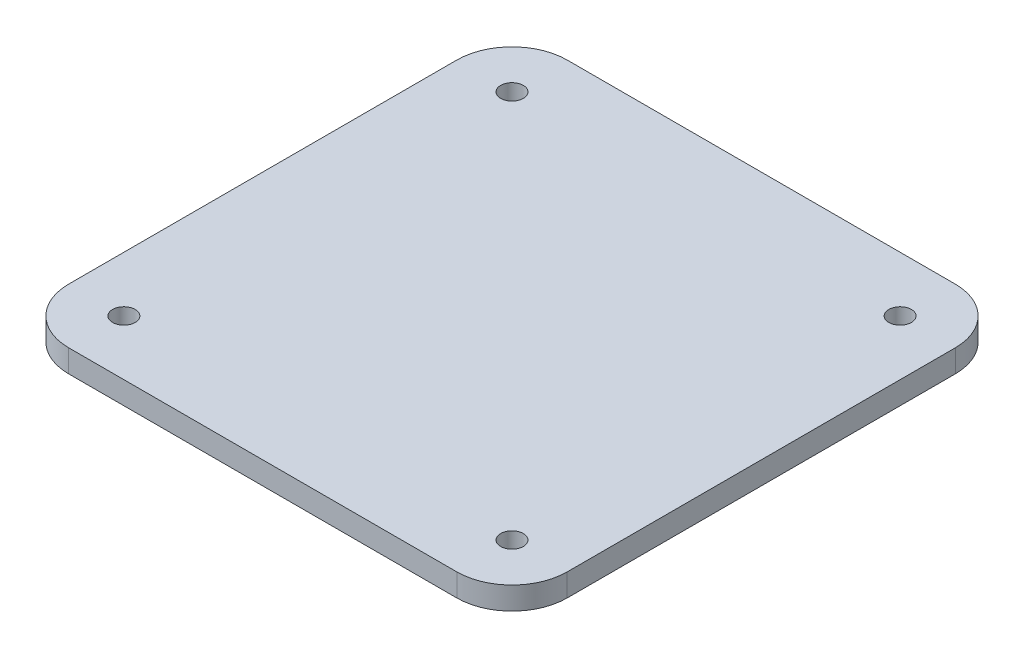
ISO-10303-21;
HEADER;
FILE_DESCRIPTION(('STEP AP214'),'2;1');
FILE_NAME('part.step','',(''),(''),'','','');
FILE_SCHEMA(('AUTOMOTIVE_DESIGN { 1 0 10303 214 1 1 1 1 }'));
ENDSEC;
DATA;
#1=APPLICATION_CONTEXT('core data for automotive mechanical design processes');
#2=APPLICATION_PROTOCOL_DEFINITION('international standard','automotive_design',2000,#1);
#3=PRODUCT_CONTEXT('',#1,'mechanical');
#4=PRODUCT('Part','Part','',(#3));
#5=PRODUCT_RELATED_PRODUCT_CATEGORY('part','',(#4));
#6=PRODUCT_DEFINITION_FORMATION('','',#4);
#7=PRODUCT_DEFINITION_CONTEXT('part definition',#1,'design');
#8=PRODUCT_DEFINITION('design','',#6,#7);
#9=PRODUCT_DEFINITION_SHAPE('','',#8);
#10=(LENGTH_UNIT() NAMED_UNIT(*) SI_UNIT(.MILLI.,.METRE.));
#11=(NAMED_UNIT(*) PLANE_ANGLE_UNIT() SI_UNIT($,.RADIAN.));
#12=(NAMED_UNIT(*) SI_UNIT($,.STERADIAN.) SOLID_ANGLE_UNIT());
#13=UNCERTAINTY_MEASURE_WITH_UNIT(LENGTH_MEASURE(1.E-05),#10,'distance_accuracy_value','');
#14=(GEOMETRIC_REPRESENTATION_CONTEXT(3) GLOBAL_UNCERTAINTY_ASSIGNED_CONTEXT((#13)) GLOBAL_UNIT_ASSIGNED_CONTEXT((#10,
#11,#12)) REPRESENTATION_CONTEXT('',''));
#15=CARTESIAN_POINT('',(0.,0.,0.));
#16=DIRECTION('',(0.,0.,1.));
#17=DIRECTION('',(1.,0.,0.));
#18=AXIS2_PLACEMENT_3D('',#15,#16,#17);
#19=CARTESIAN_POINT('',(-109.,12.7,109.));
#20=DIRECTION('',(0.,-1.,0.));
#21=DIRECTION('',(0.,0.,-1.));
#22=AXIS2_PLACEMENT_3D('',#19,#20,#21);
#23=CYLINDRICAL_SURFACE('',#22,31.);
#24=CARTESIAN_POINT('',(-109.,0.,109.));
#25=DIRECTION('',(0.,1.,0.));
#26=DIRECTION('',(0.,0.,-1.));
#27=AXIS2_PLACEMENT_3D('',#24,#25,#26);
#28=CIRCLE('',#27,31.);
#29=CARTESIAN_POINT('',(-140.,0.,109.));
#30=VERTEX_POINT('',#29);
#31=CARTESIAN_POINT('',(-109.,0.,140.));
#32=VERTEX_POINT('',#31);
#33=EDGE_CURVE('E129',#30,#32,#28,.T.);
#34=ORIENTED_EDGE('',*,*,#33,.T.);
#35=DIRECTION('',(0.,-1.,0.));
#36=VECTOR('',#35,1.);
#37=CARTESIAN_POINT('',(-109.,12.7,140.));
#38=LINE('',#37,#36);
#39=CARTESIAN_POINT('',(-109.,12.7,140.));
#40=VERTEX_POINT('',#39);
#41=EDGE_CURVE('E11',#40,#32,#38,.T.);
#42=ORIENTED_EDGE('',*,*,#41,.F.);
#43=CARTESIAN_POINT('',(-109.,12.7,109.));
#44=DIRECTION('',(0.,1.,0.));
#45=DIRECTION('',(0.,0.,-1.));
#46=AXIS2_PLACEMENT_3D('',#43,#44,#45);
#47=CIRCLE('',#46,31.);
#48=CARTESIAN_POINT('',(-140.,12.7,109.));
#49=VERTEX_POINT('',#48);
#50=EDGE_CURVE('E144',#49,#40,#47,.T.);
#51=ORIENTED_EDGE('',*,*,#50,.F.);
#52=DIRECTION('',(0.,-1.,0.));
#53=VECTOR('',#52,1.);
#54=CARTESIAN_POINT('',(-140.,12.7,109.));
#55=LINE('',#54,#53);
#56=EDGE_CURVE('E125',#49,#30,#55,.T.);
#57=ORIENTED_EDGE('',*,*,#56,.T.);
#58=EDGE_LOOP('',(#34,#42,#51,#57));
#59=FACE_BOUND('',#58,.T.);
#60=ADVANCED_FACE('F33',(#59),#23,.T.);
#61=CARTESIAN_POINT('',(-109.,12.7,140.));
#62=DIRECTION('',(0.,0.,-1.));
#63=DIRECTION('',(-1.,0.,0.));
#64=AXIS2_PLACEMENT_3D('',#61,#62,#63);
#65=PLANE('',#64);
#66=DIRECTION('',(1.,0.,0.));
#67=VECTOR('',#66,1.);
#68=CARTESIAN_POINT('',(-109.,0.,140.));
#69=LINE('',#68,#67);
#70=CARTESIAN_POINT('',(109.,0.,140.));
#71=VERTEX_POINT('',#70);
#72=EDGE_CURVE('E132',#32,#71,#69,.T.);
#73=ORIENTED_EDGE('',*,*,#72,.T.);
#74=DIRECTION('',(0.,-1.,0.));
#75=VECTOR('',#74,1.);
#76=CARTESIAN_POINT('',(109.,12.7,140.));
#77=LINE('',#76,#75);
#78=CARTESIAN_POINT('',(109.,12.7,140.));
#79=VERTEX_POINT('',#78);
#80=EDGE_CURVE('E41',#79,#71,#77,.T.);
#81=ORIENTED_EDGE('',*,*,#80,.F.);
#82=DIRECTION('',(1.,0.,0.));
#83=VECTOR('',#82,1.);
#84=CARTESIAN_POINT('',(-109.,12.7,140.));
#85=LINE('',#84,#83);
#86=EDGE_CURVE('E92',#40,#79,#85,.T.);
#87=ORIENTED_EDGE('',*,*,#86,.F.);
#88=ORIENTED_EDGE('',*,*,#41,.T.);
#89=EDGE_LOOP('',(#73,#81,#87,#88));
#90=FACE_BOUND('',#89,.T.);
#91=ADVANCED_FACE('F234',(#90),#65,.F.);
#92=CARTESIAN_POINT('',(109.,12.7,109.));
#93=DIRECTION('',(0.,-1.,0.));
#94=DIRECTION('',(0.,0.,-1.));
#95=AXIS2_PLACEMENT_3D('',#92,#93,#94);
#96=CYLINDRICAL_SURFACE('',#95,31.);
#97=CARTESIAN_POINT('',(109.,0.,109.));
#98=DIRECTION('',(0.,1.,0.));
#99=DIRECTION('',(0.,0.,1.));
#100=AXIS2_PLACEMENT_3D('',#97,#98,#99);
#101=CIRCLE('',#100,31.);
#102=CARTESIAN_POINT('',(140.,0.,109.));
#103=VERTEX_POINT('',#102);
#104=EDGE_CURVE('E135',#71,#103,#101,.T.);
#105=ORIENTED_EDGE('',*,*,#104,.T.);
#106=DIRECTION('',(0.,-1.,0.));
#107=VECTOR('',#106,1.);
#108=CARTESIAN_POINT('',(140.,12.7,109.));
#109=LINE('',#108,#107);
#110=CARTESIAN_POINT('',(140.,12.7,109.));
#111=VERTEX_POINT('',#110);
#112=EDGE_CURVE('E151',#111,#103,#109,.T.);
#113=ORIENTED_EDGE('',*,*,#112,.F.);
#114=CARTESIAN_POINT('',(109.,12.7,109.));
#115=DIRECTION('',(0.,1.,0.));
#116=DIRECTION('',(0.,0.,1.));
#117=AXIS2_PLACEMENT_3D('',#114,#115,#116);
#118=CIRCLE('',#117,31.);
#119=EDGE_CURVE('E159',#79,#111,#118,.T.);
#120=ORIENTED_EDGE('',*,*,#119,.F.);
#121=ORIENTED_EDGE('',*,*,#80,.T.);
#122=EDGE_LOOP('',(#105,#113,#120,#121));
#123=FACE_BOUND('',#122,.T.);
#124=ADVANCED_FACE('F157',(#123),#96,.T.);
#125=CARTESIAN_POINT('',(140.,12.7,109.));
#126=DIRECTION('',(-1.,0.,0.));
#127=DIRECTION('',(0.,0.,1.));
#128=AXIS2_PLACEMENT_3D('',#125,#126,#127);
#129=PLANE('',#128);
#130=DIRECTION('',(0.,0.,-1.));
#131=VECTOR('',#130,1.);
#132=CARTESIAN_POINT('',(140.,0.,109.));
#133=LINE('',#132,#131);
#134=CARTESIAN_POINT('',(140.,0.,-109.));
#135=VERTEX_POINT('',#134);
#136=EDGE_CURVE('E137',#103,#135,#133,.T.);
#137=ORIENTED_EDGE('',*,*,#136,.T.);
#138=DIRECTION('',(0.,-1.,0.));
#139=VECTOR('',#138,1.);
#140=CARTESIAN_POINT('',(140.,12.7,-109.));
#141=LINE('',#140,#139);
#142=CARTESIAN_POINT('',(140.,12.7,-109.));
#143=VERTEX_POINT('',#142);
#144=EDGE_CURVE('E148',#143,#135,#141,.T.);
#145=ORIENTED_EDGE('',*,*,#144,.F.);
#146=DIRECTION('',(0.,0.,-1.));
#147=VECTOR('',#146,1.);
#148=CARTESIAN_POINT('',(140.,12.7,109.));
#149=LINE('',#148,#147);
#150=EDGE_CURVE('E171',#111,#143,#149,.T.);
#151=ORIENTED_EDGE('',*,*,#150,.F.);
#152=ORIENTED_EDGE('',*,*,#112,.T.);
#153=EDGE_LOOP('',(#137,#145,#151,#152));
#154=FACE_BOUND('',#153,.T.);
#155=ADVANCED_FACE('F167',(#154),#129,.F.);
#156=CARTESIAN_POINT('',(109.,12.7,-109.));
#157=DIRECTION('',(0.,-1.,0.));
#158=DIRECTION('',(0.,0.,-1.));
#159=AXIS2_PLACEMENT_3D('',#156,#157,#158);
#160=CYLINDRICAL_SURFACE('',#159,31.);
#161=CARTESIAN_POINT('',(109.,0.,-109.));
#162=DIRECTION('',(0.,1.,0.));
#163=DIRECTION('',(0.,0.,-1.));
#164=AXIS2_PLACEMENT_3D('',#161,#162,#163);
#165=CIRCLE('',#164,31.);
#166=CARTESIAN_POINT('',(109.,0.,-140.));
#167=VERTEX_POINT('',#166);
#168=EDGE_CURVE('E139',#135,#167,#165,.T.);
#169=ORIENTED_EDGE('',*,*,#168,.T.);
#170=DIRECTION('',(0.,-1.,0.));
#171=VECTOR('',#170,1.);
#172=CARTESIAN_POINT('',(109.,12.7,-140.));
#173=LINE('',#172,#171);
#174=CARTESIAN_POINT('',(109.,12.7,-140.));
#175=VERTEX_POINT('',#174);
#176=EDGE_CURVE('E120',#175,#167,#173,.T.);
#177=ORIENTED_EDGE('',*,*,#176,.F.);
#178=CARTESIAN_POINT('',(109.,12.7,-109.));
#179=DIRECTION('',(0.,1.,0.));
#180=DIRECTION('',(0.,0.,-1.));
#181=AXIS2_PLACEMENT_3D('',#178,#179,#180);
#182=CIRCLE('',#181,31.);
#183=EDGE_CURVE('E111',#143,#175,#182,.T.);
#184=ORIENTED_EDGE('',*,*,#183,.F.);
#185=ORIENTED_EDGE('',*,*,#144,.T.);
#186=EDGE_LOOP('',(#169,#177,#184,#185));
#187=FACE_BOUND('',#186,.T.);
#188=ADVANCED_FACE('F170',(#187),#160,.T.);
#189=CARTESIAN_POINT('',(-109.,12.7,-140.));
#190=DIRECTION('',(0.,0.,1.));
#191=DIRECTION('',(1.,0.,0.));
#192=AXIS2_PLACEMENT_3D('',#189,#190,#191);
#193=PLANE('',#192);
#194=DIRECTION('',(-1.,0.,0.));
#195=VECTOR('',#194,1.);
#196=CARTESIAN_POINT('',(-109.,0.,-140.));
#197=LINE('',#196,#195);
#198=CARTESIAN_POINT('',(-109.,0.,-140.));
#199=VERTEX_POINT('',#198);
#200=EDGE_CURVE('E119',#167,#199,#197,.T.);
#201=ORIENTED_EDGE('',*,*,#200,.T.);
#202=DIRECTION('',(0.,-1.,0.));
#203=VECTOR('',#202,1.);
#204=CARTESIAN_POINT('',(-109.,12.7,-140.));
#205=LINE('',#204,#203);
#206=CARTESIAN_POINT('',(-109.,12.7,-140.));
#207=VERTEX_POINT('',#206);
#208=EDGE_CURVE('E116',#207,#199,#205,.T.);
#209=ORIENTED_EDGE('',*,*,#208,.F.);
#210=DIRECTION('',(-1.,0.,0.));
#211=VECTOR('',#210,1.);
#212=CARTESIAN_POINT('',(-109.,12.7,-140.));
#213=LINE('',#212,#211);
#214=EDGE_CURVE('E105',#175,#207,#213,.T.);
#215=ORIENTED_EDGE('',*,*,#214,.F.);
#216=ORIENTED_EDGE('',*,*,#176,.T.);
#217=EDGE_LOOP('',(#201,#209,#215,#216));
#218=FACE_BOUND('',#217,.T.);
#219=ADVANCED_FACE('F117',(#218),#193,.F.);
#220=CARTESIAN_POINT('',(-109.,12.7,-109.));
#221=DIRECTION('',(0.,-1.,0.));
#222=DIRECTION('',(0.,0.,-1.));
#223=AXIS2_PLACEMENT_3D('',#220,#221,#222);
#224=CYLINDRICAL_SURFACE('',#223,31.);
#225=CARTESIAN_POINT('',(-109.,0.,-109.));
#226=DIRECTION('',(0.,1.,0.));
#227=DIRECTION('',(0.,0.,-1.));
#228=AXIS2_PLACEMENT_3D('',#225,#226,#227);
#229=CIRCLE('',#228,31.);
#230=CARTESIAN_POINT('',(-140.,0.,-109.));
#231=VERTEX_POINT('',#230);
#232=EDGE_CURVE('E78',#199,#231,#229,.T.);
#233=ORIENTED_EDGE('',*,*,#232,.T.);
#234=DIRECTION('',(0.,-1.,0.));
#235=VECTOR('',#234,1.);
#236=CARTESIAN_POINT('',(-140.,12.7,-109.));
#237=LINE('',#236,#235);
#238=CARTESIAN_POINT('',(-140.,12.7,-109.));
#239=VERTEX_POINT('',#238);
#240=EDGE_CURVE('E121',#239,#231,#237,.T.);
#241=ORIENTED_EDGE('',*,*,#240,.F.);
#242=CARTESIAN_POINT('',(-109.,12.7,-109.));
#243=DIRECTION('',(0.,1.,0.));
#244=DIRECTION('',(0.,0.,-1.));
#245=AXIS2_PLACEMENT_3D('',#242,#243,#244);
#246=CIRCLE('',#245,31.);
#247=EDGE_CURVE('E109',#207,#239,#246,.T.);
#248=ORIENTED_EDGE('',*,*,#247,.F.);
#249=ORIENTED_EDGE('',*,*,#208,.T.);
#250=EDGE_LOOP('',(#233,#241,#248,#249));
#251=FACE_BOUND('',#250,.T.);
#252=ADVANCED_FACE('F123',(#251),#224,.T.);
#253=CARTESIAN_POINT('',(-140.,12.7,109.));
#254=DIRECTION('',(1.,0.,0.));
#255=DIRECTION('',(0.,0.,-1.));
#256=AXIS2_PLACEMENT_3D('',#253,#254,#255);
#257=PLANE('',#256);
#258=DIRECTION('',(0.,0.,1.));
#259=VECTOR('',#258,1.);
#260=CARTESIAN_POINT('',(-140.,0.,109.));
#261=LINE('',#260,#259);
#262=EDGE_CURVE('E84',#231,#30,#261,.T.);
#263=ORIENTED_EDGE('',*,*,#262,.T.);
#264=ORIENTED_EDGE('',*,*,#56,.F.);
#265=DIRECTION('',(0.,0.,1.));
#266=VECTOR('',#265,1.);
#267=CARTESIAN_POINT('',(-140.,12.7,109.));
#268=LINE('',#267,#266);
#269=EDGE_CURVE('E49',#239,#49,#268,.T.);
#270=ORIENTED_EDGE('',*,*,#269,.F.);
#271=ORIENTED_EDGE('',*,*,#240,.T.);
#272=EDGE_LOOP('',(#263,#264,#270,#271));
#273=FACE_BOUND('',#272,.T.);
#274=ADVANCED_FACE('F212',(#273),#257,.F.);
#275=CARTESIAN_POINT('',(-109.,12.7,109.));
#276=DIRECTION('',(0.,-1.,0.));
#277=DIRECTION('',(0.,0.,-1.));
#278=AXIS2_PLACEMENT_3D('',#275,#276,#277);
#279=PLANE('',#278);
#280=CARTESIAN_POINT('',(-109.,12.7,-109.));
#281=DIRECTION('',(0.,1.,0.));
#282=DIRECTION('',(0.,0.,1.));
#283=AXIS2_PLACEMENT_3D('',#280,#281,#282);
#284=CIRCLE('',#283,6.34999999999999);
#285=CARTESIAN_POINT('',(-109.,12.7,-102.65));
#286=VERTEX_POINT('',#285);
#287=EDGE_CURVE('E195',#286,#286,#284,.T.);
#288=ORIENTED_EDGE('',*,*,#287,.F.);
#289=EDGE_LOOP('',(#288));
#290=FACE_BOUND('',#289,.T.);
#291=CARTESIAN_POINT('',(-109.,12.7,109.));
#292=DIRECTION('',(0.,1.,0.));
#293=DIRECTION('',(0.,0.,1.));
#294=AXIS2_PLACEMENT_3D('',#291,#292,#293);
#295=CIRCLE('',#294,6.35000000000048);
#296=CARTESIAN_POINT('',(-109.,12.7,115.35));
#297=VERTEX_POINT('',#296);
#298=EDGE_CURVE('E189',#297,#297,#295,.T.);
#299=ORIENTED_EDGE('',*,*,#298,.F.);
#300=EDGE_LOOP('',(#299));
#301=FACE_BOUND('',#300,.T.);
#302=CARTESIAN_POINT('',(109.,12.7,109.));
#303=DIRECTION('',(0.,1.,0.));
#304=DIRECTION('',(0.,0.,1.));
#305=AXIS2_PLACEMENT_3D('',#302,#303,#304);
#306=CIRCLE('',#305,6.35000000000027);
#307=CARTESIAN_POINT('',(109.,12.7,115.35));
#308=VERTEX_POINT('',#307);
#309=EDGE_CURVE('E183',#308,#308,#306,.T.);
#310=ORIENTED_EDGE('',*,*,#309,.F.);
#311=EDGE_LOOP('',(#310));
#312=FACE_BOUND('',#311,.T.);
#313=CARTESIAN_POINT('',(109.,12.7,-109.));
#314=DIRECTION('',(0.,1.,0.));
#315=DIRECTION('',(0.,0.,1.));
#316=AXIS2_PLACEMENT_3D('',#313,#314,#315);
#317=CIRCLE('',#316,6.34999999999999);
#318=CARTESIAN_POINT('',(109.,12.7,-102.65));
#319=VERTEX_POINT('',#318);
#320=EDGE_CURVE('E177',#319,#319,#317,.T.);
#321=ORIENTED_EDGE('',*,*,#320,.F.);
#322=EDGE_LOOP('',(#321));
#323=FACE_BOUND('',#322,.T.);
#324=ORIENTED_EDGE('',*,*,#50,.T.);
#325=ORIENTED_EDGE('',*,*,#86,.T.);
#326=ORIENTED_EDGE('',*,*,#119,.T.);
#327=ORIENTED_EDGE('',*,*,#150,.T.);
#328=ORIENTED_EDGE('',*,*,#183,.T.);
#329=ORIENTED_EDGE('',*,*,#214,.T.);
#330=ORIENTED_EDGE('',*,*,#247,.T.);
#331=ORIENTED_EDGE('',*,*,#269,.T.);
#332=EDGE_LOOP('',(#324,#325,#326,#327,#328,#329,#330,#331));
#333=FACE_BOUND('',#332,.T.);
#334=ADVANCED_FACE('F107',(#290,#301,#312,#323,#333),#279,.F.);
#335=CARTESIAN_POINT('',(-109.,0.,109.));
#336=DIRECTION('',(0.,-1.,0.));
#337=DIRECTION('',(0.,0.,-1.));
#338=AXIS2_PLACEMENT_3D('',#335,#336,#337);
#339=PLANE('',#338);
#340=CARTESIAN_POINT('',(-109.,0.,-109.));
#341=DIRECTION('',(0.,1.,0.));
#342=DIRECTION('',(0.,0.,1.));
#343=AXIS2_PLACEMENT_3D('',#340,#341,#342);
#344=CIRCLE('',#343,6.34999999999999);
#345=CARTESIAN_POINT('',(-109.,0.,-102.65));
#346=VERTEX_POINT('',#345);
#347=EDGE_CURVE('E192',#346,#346,#344,.T.);
#348=ORIENTED_EDGE('',*,*,#347,.T.);
#349=EDGE_LOOP('',(#348));
#350=FACE_BOUND('',#349,.T.);
#351=CARTESIAN_POINT('',(-109.,0.,109.));
#352=DIRECTION('',(0.,1.,0.));
#353=DIRECTION('',(0.,0.,1.));
#354=AXIS2_PLACEMENT_3D('',#351,#352,#353);
#355=CIRCLE('',#354,6.35000000000048);
#356=CARTESIAN_POINT('',(-109.,0.,115.35));
#357=VERTEX_POINT('',#356);
#358=EDGE_CURVE('E186',#357,#357,#355,.T.);
#359=ORIENTED_EDGE('',*,*,#358,.T.);
#360=EDGE_LOOP('',(#359));
#361=FACE_BOUND('',#360,.T.);
#362=CARTESIAN_POINT('',(109.,0.,109.));
#363=DIRECTION('',(0.,1.,0.));
#364=DIRECTION('',(0.,0.,1.));
#365=AXIS2_PLACEMENT_3D('',#362,#363,#364);
#366=CIRCLE('',#365,6.35000000000027);
#367=CARTESIAN_POINT('',(109.,0.,115.35));
#368=VERTEX_POINT('',#367);
#369=EDGE_CURVE('E180',#368,#368,#366,.T.);
#370=ORIENTED_EDGE('',*,*,#369,.T.);
#371=EDGE_LOOP('',(#370));
#372=FACE_BOUND('',#371,.T.);
#373=CARTESIAN_POINT('',(109.,0.,-109.));
#374=DIRECTION('',(0.,1.,0.));
#375=DIRECTION('',(0.,0.,1.));
#376=AXIS2_PLACEMENT_3D('',#373,#374,#375);
#377=CIRCLE('',#376,6.34999999999999);
#378=CARTESIAN_POINT('',(109.,0.,-102.65));
#379=VERTEX_POINT('',#378);
#380=EDGE_CURVE('E133',#379,#379,#377,.T.);
#381=ORIENTED_EDGE('',*,*,#380,.T.);
#382=EDGE_LOOP('',(#381));
#383=FACE_BOUND('',#382,.T.);
#384=ORIENTED_EDGE('',*,*,#33,.F.);
#385=ORIENTED_EDGE('',*,*,#262,.F.);
#386=ORIENTED_EDGE('',*,*,#232,.F.);
#387=ORIENTED_EDGE('',*,*,#200,.F.);
#388=ORIENTED_EDGE('',*,*,#168,.F.);
#389=ORIENTED_EDGE('',*,*,#136,.F.);
#390=ORIENTED_EDGE('',*,*,#104,.F.);
#391=ORIENTED_EDGE('',*,*,#72,.F.);
#392=EDGE_LOOP('',(#384,#385,#386,#387,#388,#389,#390,#391));
#393=FACE_BOUND('',#392,.T.);
#394=ADVANCED_FACE('F163',(#350,#361,#372,#383,#393),#339,.T.);
#395=CARTESIAN_POINT('',(109.,0.,-109.));
#396=DIRECTION('',(0.,1.,0.));
#397=DIRECTION('',(0.,0.,1.));
#398=AXIS2_PLACEMENT_3D('',#395,#396,#397);
#399=CYLINDRICAL_SURFACE('',#398,6.34999999999999);
#400=ORIENTED_EDGE('',*,*,#380,.F.);
#401=EDGE_LOOP('',(#400));
#402=FACE_BOUND('',#401,.T.);
#403=ORIENTED_EDGE('',*,*,#320,.T.);
#404=EDGE_LOOP('',(#403));
#405=FACE_BOUND('',#404,.T.);
#406=ADVANCED_FACE('F220',(#402,#405),#399,.F.);
#407=CARTESIAN_POINT('',(109.,0.,109.));
#408=DIRECTION('',(0.,1.,0.));
#409=DIRECTION('',(0.,0.,1.));
#410=AXIS2_PLACEMENT_3D('',#407,#408,#409);
#411=CYLINDRICAL_SURFACE('',#410,6.35000000000027);
#412=ORIENTED_EDGE('',*,*,#369,.F.);
#413=EDGE_LOOP('',(#412));
#414=FACE_BOUND('',#413,.T.);
#415=ORIENTED_EDGE('',*,*,#309,.T.);
#416=EDGE_LOOP('',(#415));
#417=FACE_BOUND('',#416,.T.);
#418=ADVANCED_FACE('F222',(#414,#417),#411,.F.);
#419=CARTESIAN_POINT('',(-109.,0.,109.));
#420=DIRECTION('',(0.,1.,0.));
#421=DIRECTION('',(0.,0.,1.));
#422=AXIS2_PLACEMENT_3D('',#419,#420,#421);
#423=CYLINDRICAL_SURFACE('',#422,6.35000000000048);
#424=ORIENTED_EDGE('',*,*,#358,.F.);
#425=EDGE_LOOP('',(#424));
#426=FACE_BOUND('',#425,.T.);
#427=ORIENTED_EDGE('',*,*,#298,.T.);
#428=EDGE_LOOP('',(#427));
#429=FACE_BOUND('',#428,.T.);
#430=ADVANCED_FACE('F206',(#426,#429),#423,.F.);
#431=CARTESIAN_POINT('',(-109.,0.,-109.));
#432=DIRECTION('',(0.,1.,0.));
#433=DIRECTION('',(0.,0.,1.));
#434=AXIS2_PLACEMENT_3D('',#431,#432,#433);
#435=CYLINDRICAL_SURFACE('',#434,6.34999999999999);
#436=ORIENTED_EDGE('',*,*,#347,.F.);
#437=EDGE_LOOP('',(#436));
#438=FACE_BOUND('',#437,.T.);
#439=ORIENTED_EDGE('',*,*,#287,.T.);
#440=EDGE_LOOP('',(#439));
#441=FACE_BOUND('',#440,.T.);
#442=ADVANCED_FACE('F203',(#438,#441),#435,.F.);
#443=CLOSED_SHELL('',(#60,#91,#124,#155,#188,#219,#252,#274,#334,#394,#406,#418,#430,#442));
#444=MANIFOLD_SOLID_BREP('B2',#443);
#445=ADVANCED_BREP_SHAPE_REPRESENTATION('',(#18,#444),#14);
#446=SHAPE_DEFINITION_REPRESENTATION(#9,#445);
ENDSEC;
END-ISO-10303-21;
